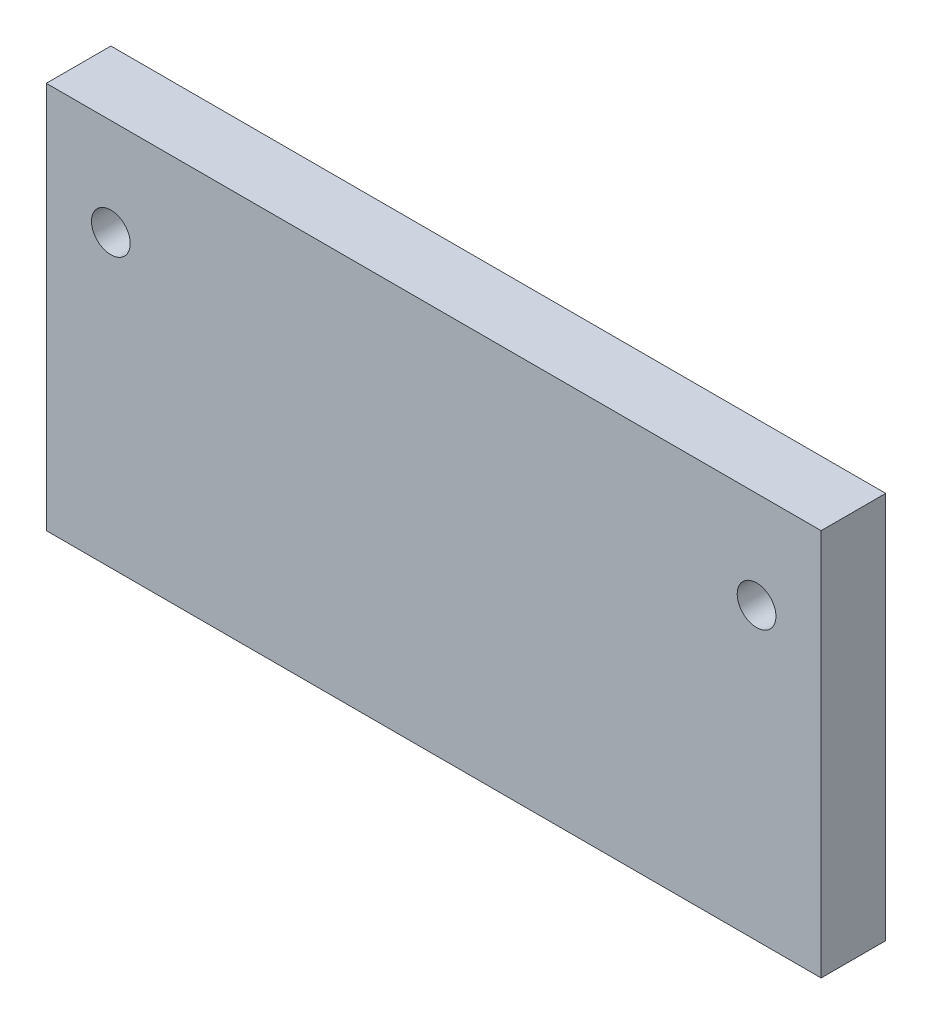
ISO-10303-21;
HEADER;
FILE_DESCRIPTION(('STEP AP214'),'2;1');
FILE_NAME('part.step','',(''),(''),'','','');
FILE_SCHEMA(('AUTOMOTIVE_DESIGN { 1 0 10303 214 1 1 1 1 }'));
ENDSEC;
DATA;
#1=APPLICATION_CONTEXT('core data for automotive mechanical design processes');
#2=APPLICATION_PROTOCOL_DEFINITION('international standard','automotive_design',2000,#1);
#3=PRODUCT_CONTEXT('',#1,'mechanical');
#4=PRODUCT('Part','Part','',(#3));
#5=PRODUCT_RELATED_PRODUCT_CATEGORY('part','',(#4));
#6=PRODUCT_DEFINITION_FORMATION('','',#4);
#7=PRODUCT_DEFINITION_CONTEXT('part definition',#1,'design');
#8=PRODUCT_DEFINITION('design','',#6,#7);
#9=PRODUCT_DEFINITION_SHAPE('','',#8);
#10=(LENGTH_UNIT() NAMED_UNIT(*) SI_UNIT(.MILLI.,.METRE.));
#11=(NAMED_UNIT(*) PLANE_ANGLE_UNIT() SI_UNIT($,.RADIAN.));
#12=(NAMED_UNIT(*) SI_UNIT($,.STERADIAN.) SOLID_ANGLE_UNIT());
#13=UNCERTAINTY_MEASURE_WITH_UNIT(LENGTH_MEASURE(1.E-05),#10,'distance_accuracy_value','');
#14=(GEOMETRIC_REPRESENTATION_CONTEXT(3) GLOBAL_UNCERTAINTY_ASSIGNED_CONTEXT((#13)) GLOBAL_UNIT_ASSIGNED_CONTEXT((#10,
#11,#12)) REPRESENTATION_CONTEXT('',''));
#15=CARTESIAN_POINT('',(0.,0.,0.));
#16=DIRECTION('',(0.,0.,1.));
#17=DIRECTION('',(1.,0.,0.));
#18=AXIS2_PLACEMENT_3D('',#15,#16,#17);
#19=CARTESIAN_POINT('',(0.,0.,-10.6801801801802));
#20=DIRECTION('',(0.,0.,1.));
#21=DIRECTION('',(1.,0.,0.));
#22=AXIS2_PLACEMENT_3D('',#19,#20,#21);
#23=PLANE('',#22);
#24=DIRECTION('',(0.,1.,0.));
#25=VECTOR('',#24,1.);
#26=CARTESIAN_POINT('',(-3.27927927927926,15.,-10.6801801801802));
#27=LINE('',#26,#25);
#28=CARTESIAN_POINT('',(-3.27927927927926,-15.,-10.6801801801802));
#29=VERTEX_POINT('',#28);
#30=CARTESIAN_POINT('',(-3.27927927927926,15.,-10.6801801801802));
#31=VERTEX_POINT('',#30);
#32=EDGE_CURVE('E84',#29,#31,#27,.T.);
#33=ORIENTED_EDGE('',*,*,#32,.T.);
#34=DIRECTION('',(1.,0.,0.));
#35=VECTOR('',#34,1.);
#36=CARTESIAN_POINT('',(-3.27927927927926,15.,-10.6801801801802));
#37=LINE('',#36,#35);
#38=CARTESIAN_POINT('',(56.7207207207207,15.,-10.6801801801802));
#39=VERTEX_POINT('',#38);
#40=EDGE_CURVE('E79',#31,#39,#37,.T.);
#41=ORIENTED_EDGE('',*,*,#40,.T.);
#42=DIRECTION('',(0.,-1.,0.));
#43=VECTOR('',#42,1.);
#44=CARTESIAN_POINT('',(56.7207207207207,15.,-10.6801801801802));
#45=LINE('',#44,#43);
#46=CARTESIAN_POINT('',(56.7207207207207,-15.,-10.6801801801802));
#47=VERTEX_POINT('',#46);
#48=EDGE_CURVE('E82',#39,#47,#45,.T.);
#49=ORIENTED_EDGE('',*,*,#48,.T.);
#50=DIRECTION('',(-1.,0.,0.));
#51=VECTOR('',#50,1.);
#52=CARTESIAN_POINT('',(-3.27927927927926,-15.,-10.6801801801802));
#53=LINE('',#52,#51);
#54=EDGE_CURVE('E49',#47,#29,#53,.T.);
#55=ORIENTED_EDGE('',*,*,#54,.T.);
#56=EDGE_LOOP('',(#33,#41,#49,#55));
#57=FACE_BOUND('',#56,.T.);
#58=CARTESIAN_POINT('',(51.7207207207207,7.5,-10.6801801801802));
#59=DIRECTION('',(0.,0.,-1.));
#60=DIRECTION('',(-1.,0.,0.));
#61=AXIS2_PLACEMENT_3D('',#58,#59,#60);
#62=CIRCLE('',#61,1.5);
#63=CARTESIAN_POINT('',(50.2207207207207,7.5,-10.6801801801802));
#64=VERTEX_POINT('',#63);
#65=EDGE_CURVE('E99',#64,#64,#62,.T.);
#66=ORIENTED_EDGE('',*,*,#65,.F.);
#67=EDGE_LOOP('',(#66));
#68=FACE_BOUND('',#67,.T.);
#69=CARTESIAN_POINT('',(1.72072072072074,7.5,-10.6801801801802));
#70=DIRECTION('',(0.,0.,-1.));
#71=DIRECTION('',(-1.,0.,0.));
#72=AXIS2_PLACEMENT_3D('',#69,#70,#71);
#73=CIRCLE('',#72,1.5);
#74=CARTESIAN_POINT('',(0.220720720720739,7.5,-10.6801801801802));
#75=VERTEX_POINT('',#74);
#76=EDGE_CURVE('E114',#75,#75,#73,.T.);
#77=ORIENTED_EDGE('',*,*,#76,.F.);
#78=EDGE_LOOP('',(#77));
#79=FACE_BOUND('',#78,.T.);
#80=ADVANCED_FACE('F32',(#57,#68,#79),#23,.F.);
#81=CARTESIAN_POINT('',(0.,0.,-5.68018018018018));
#82=DIRECTION('',(0.,0.,1.));
#83=DIRECTION('',(1.,0.,0.));
#84=AXIS2_PLACEMENT_3D('',#81,#82,#83);
#85=PLANE('',#84);
#86=CARTESIAN_POINT('',(51.7207207207207,7.5,-5.68018018018018));
#87=DIRECTION('',(0.,0.,-1.));
#88=DIRECTION('',(-1.,0.,0.));
#89=AXIS2_PLACEMENT_3D('',#86,#87,#88);
#90=CIRCLE('',#89,1.5);
#91=CARTESIAN_POINT('',(50.2207207207207,7.5,-5.68018018018018));
#92=VERTEX_POINT('',#91);
#93=EDGE_CURVE('E111',#92,#92,#90,.T.);
#94=ORIENTED_EDGE('',*,*,#93,.T.);
#95=EDGE_LOOP('',(#94));
#96=FACE_BOUND('',#95,.T.);
#97=DIRECTION('',(0.,1.,0.));
#98=VECTOR('',#97,1.);
#99=CARTESIAN_POINT('',(-3.27927927927926,15.,-5.68018018018018));
#100=LINE('',#99,#98);
#101=CARTESIAN_POINT('',(-3.27927927927926,-15.,-5.68018018018018));
#102=VERTEX_POINT('',#101);
#103=CARTESIAN_POINT('',(-3.27927927927926,15.,-5.68018018018018));
#104=VERTEX_POINT('',#103);
#105=EDGE_CURVE('E96',#102,#104,#100,.T.);
#106=ORIENTED_EDGE('',*,*,#105,.F.);
#107=DIRECTION('',(-1.,0.,0.));
#108=VECTOR('',#107,1.);
#109=CARTESIAN_POINT('',(-3.27927927927926,-15.,-5.68018018018018));
#110=LINE('',#109,#108);
#111=CARTESIAN_POINT('',(56.7207207207207,-15.,-5.68018018018018));
#112=VERTEX_POINT('',#111);
#113=EDGE_CURVE('E72',#112,#102,#110,.T.);
#114=ORIENTED_EDGE('',*,*,#113,.F.);
#115=DIRECTION('',(0.,-1.,0.));
#116=VECTOR('',#115,1.);
#117=CARTESIAN_POINT('',(56.7207207207207,15.,-5.68018018018018));
#118=LINE('',#117,#116);
#119=CARTESIAN_POINT('',(56.7207207207207,15.,-5.68018018018018));
#120=VERTEX_POINT('',#119);
#121=EDGE_CURVE('E66',#120,#112,#118,.T.);
#122=ORIENTED_EDGE('',*,*,#121,.F.);
#123=DIRECTION('',(1.,0.,0.));
#124=VECTOR('',#123,1.);
#125=CARTESIAN_POINT('',(-3.27927927927926,15.,-5.68018018018018));
#126=LINE('',#125,#124);
#127=EDGE_CURVE('E88',#104,#120,#126,.T.);
#128=ORIENTED_EDGE('',*,*,#127,.F.);
#129=EDGE_LOOP('',(#106,#114,#122,#128));
#130=FACE_BOUND('',#129,.T.);
#131=CARTESIAN_POINT('',(1.72072072072074,7.5,-5.68018018018018));
#132=DIRECTION('',(0.,0.,-1.));
#133=DIRECTION('',(-1.,0.,0.));
#134=AXIS2_PLACEMENT_3D('',#131,#132,#133);
#135=CIRCLE('',#134,1.5);
#136=CARTESIAN_POINT('',(0.220720720720739,7.5,-5.68018018018018));
#137=VERTEX_POINT('',#136);
#138=EDGE_CURVE('E117',#137,#137,#135,.T.);
#139=ORIENTED_EDGE('',*,*,#138,.T.);
#140=EDGE_LOOP('',(#139));
#141=FACE_BOUND('',#140,.T.);
#142=ADVANCED_FACE('F107',(#96,#130,#141),#85,.T.);
#143=CARTESIAN_POINT('',(-3.27927927927926,15.,-10.6801801801802));
#144=DIRECTION('',(1.,0.,0.));
#145=DIRECTION('',(0.,1.,0.));
#146=AXIS2_PLACEMENT_3D('',#143,#144,#145);
#147=PLANE('',#146);
#148=ORIENTED_EDGE('',*,*,#105,.T.);
#149=DIRECTION('',(0.,0.,1.));
#150=VECTOR('',#149,1.);
#151=CARTESIAN_POINT('',(-3.27927927927926,15.,-10.6801801801802));
#152=LINE('',#151,#150);
#153=EDGE_CURVE('E11',#31,#104,#152,.T.);
#154=ORIENTED_EDGE('',*,*,#153,.F.);
#155=ORIENTED_EDGE('',*,*,#32,.F.);
#156=DIRECTION('',(0.,0.,1.));
#157=VECTOR('',#156,1.);
#158=CARTESIAN_POINT('',(-3.27927927927926,-15.,-10.6801801801802));
#159=LINE('',#158,#157);
#160=EDGE_CURVE('E92',#29,#102,#159,.T.);
#161=ORIENTED_EDGE('',*,*,#160,.T.);
#162=EDGE_LOOP('',(#148,#154,#155,#161));
#163=FACE_BOUND('',#162,.T.);
#164=ADVANCED_FACE('F34',(#163),#147,.F.);
#165=CARTESIAN_POINT('',(-3.27927927927926,15.,-10.6801801801802));
#166=DIRECTION('',(0.,-1.,0.));
#167=DIRECTION('',(1.,0.,0.));
#168=AXIS2_PLACEMENT_3D('',#165,#166,#167);
#169=PLANE('',#168);
#170=ORIENTED_EDGE('',*,*,#127,.T.);
#171=DIRECTION('',(0.,0.,1.));
#172=VECTOR('',#171,1.);
#173=CARTESIAN_POINT('',(56.7207207207207,15.,-10.6801801801802));
#174=LINE('',#173,#172);
#175=EDGE_CURVE('E41',#39,#120,#174,.T.);
#176=ORIENTED_EDGE('',*,*,#175,.F.);
#177=ORIENTED_EDGE('',*,*,#40,.F.);
#178=ORIENTED_EDGE('',*,*,#153,.T.);
#179=EDGE_LOOP('',(#170,#176,#177,#178));
#180=FACE_BOUND('',#179,.T.);
#181=ADVANCED_FACE('F87',(#180),#169,.F.);
#182=CARTESIAN_POINT('',(56.7207207207207,15.,-10.6801801801802));
#183=DIRECTION('',(-1.,0.,0.));
#184=DIRECTION('',(0.,-1.,0.));
#185=AXIS2_PLACEMENT_3D('',#182,#183,#184);
#186=PLANE('',#185);
#187=ORIENTED_EDGE('',*,*,#121,.T.);
#188=DIRECTION('',(0.,0.,1.));
#189=VECTOR('',#188,1.);
#190=CARTESIAN_POINT('',(56.7207207207207,-15.,-10.6801801801802));
#191=LINE('',#190,#189);
#192=EDGE_CURVE('E89',#47,#112,#191,.T.);
#193=ORIENTED_EDGE('',*,*,#192,.F.);
#194=ORIENTED_EDGE('',*,*,#48,.F.);
#195=ORIENTED_EDGE('',*,*,#175,.T.);
#196=EDGE_LOOP('',(#187,#193,#194,#195));
#197=FACE_BOUND('',#196,.T.);
#198=ADVANCED_FACE('F90',(#197),#186,.F.);
#199=CARTESIAN_POINT('',(-3.27927927927926,-15.,-10.6801801801802));
#200=DIRECTION('',(0.,1.,0.));
#201=DIRECTION('',(-1.,0.,0.));
#202=AXIS2_PLACEMENT_3D('',#199,#200,#201);
#203=PLANE('',#202);
#204=ORIENTED_EDGE('',*,*,#113,.T.);
#205=ORIENTED_EDGE('',*,*,#160,.F.);
#206=ORIENTED_EDGE('',*,*,#54,.F.);
#207=ORIENTED_EDGE('',*,*,#192,.T.);
#208=EDGE_LOOP('',(#204,#205,#206,#207));
#209=FACE_BOUND('',#208,.T.);
#210=ADVANCED_FACE('F104',(#209),#203,.F.);
#211=CARTESIAN_POINT('',(51.7207207207207,7.5,-10.6801801801802));
#212=DIRECTION('',(0.,0.,1.));
#213=DIRECTION('',(1.,0.,0.));
#214=AXIS2_PLACEMENT_3D('',#211,#212,#213);
#215=CYLINDRICAL_SURFACE('',#214,1.5);
#216=ORIENTED_EDGE('',*,*,#65,.T.);
#217=EDGE_LOOP('',(#216));
#218=FACE_BOUND('',#217,.T.);
#219=ORIENTED_EDGE('',*,*,#93,.F.);
#220=EDGE_LOOP('',(#219));
#221=FACE_BOUND('',#220,.T.);
#222=ADVANCED_FACE('F134',(#218,#221),#215,.F.);
#223=CARTESIAN_POINT('',(1.72072072072074,7.5,-10.6801801801802));
#224=DIRECTION('',(0.,0.,1.));
#225=DIRECTION('',(1.,0.,0.));
#226=AXIS2_PLACEMENT_3D('',#223,#224,#225);
#227=CYLINDRICAL_SURFACE('',#226,1.5);
#228=ORIENTED_EDGE('',*,*,#76,.T.);
#229=EDGE_LOOP('',(#228));
#230=FACE_BOUND('',#229,.T.);
#231=ORIENTED_EDGE('',*,*,#138,.F.);
#232=EDGE_LOOP('',(#231));
#233=FACE_BOUND('',#232,.T.);
#234=ADVANCED_FACE('F123',(#230,#233),#227,.F.);
#235=CLOSED_SHELL('',(#80,#142,#164,#181,#198,#210,#222,#234));
#236=MANIFOLD_SOLID_BREP('B2',#235);
#237=ADVANCED_BREP_SHAPE_REPRESENTATION('',(#18,#236),#14);
#238=SHAPE_DEFINITION_REPRESENTATION(#9,#237);
ENDSEC;
END-ISO-10303-21;
